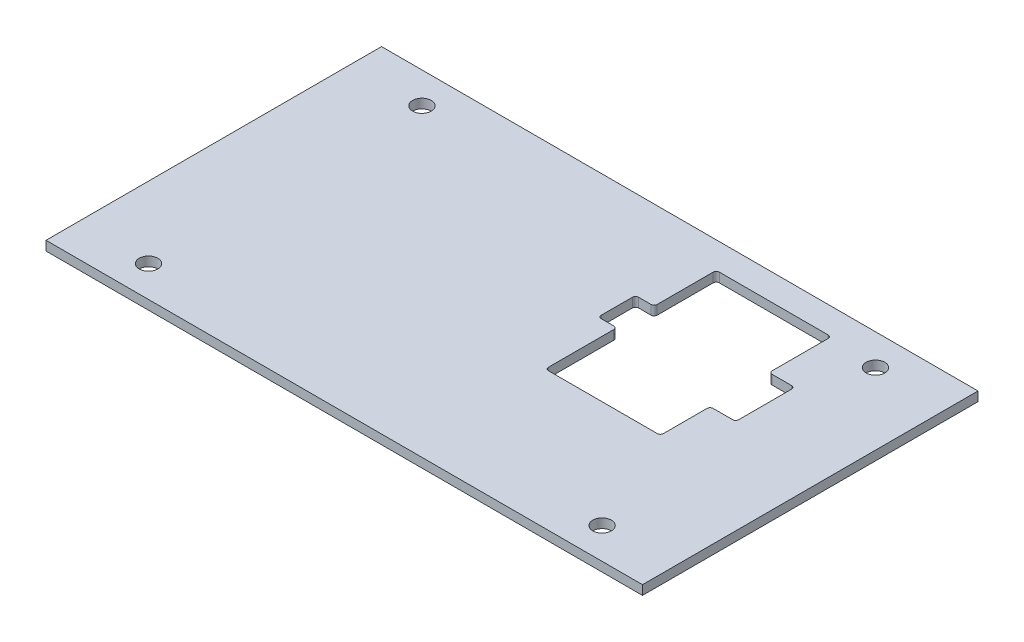
ISO-10303-21;
HEADER;
FILE_DESCRIPTION(('STEP AP214'),'2;1');
FILE_NAME('part.step','',(''),(''),'','','');
FILE_SCHEMA(('AUTOMOTIVE_DESIGN { 1 0 10303 214 1 1 1 1 }'));
ENDSEC;
DATA;
#1=APPLICATION_CONTEXT('core data for automotive mechanical design processes');
#2=APPLICATION_PROTOCOL_DEFINITION('international standard','automotive_design',2000,#1);
#3=PRODUCT_CONTEXT('',#1,'mechanical');
#4=PRODUCT('Part','Part','',(#3));
#5=PRODUCT_RELATED_PRODUCT_CATEGORY('part','',(#4));
#6=PRODUCT_DEFINITION_FORMATION('','',#4);
#7=PRODUCT_DEFINITION_CONTEXT('part definition',#1,'design');
#8=PRODUCT_DEFINITION('design','',#6,#7);
#9=PRODUCT_DEFINITION_SHAPE('','',#8);
#10=(LENGTH_UNIT() NAMED_UNIT(*) SI_UNIT(.MILLI.,.METRE.));
#11=(NAMED_UNIT(*) PLANE_ANGLE_UNIT() SI_UNIT($,.RADIAN.));
#12=(NAMED_UNIT(*) SI_UNIT($,.STERADIAN.) SOLID_ANGLE_UNIT());
#13=UNCERTAINTY_MEASURE_WITH_UNIT(LENGTH_MEASURE(1.E-05),#10,'distance_accuracy_value','');
#14=(GEOMETRIC_REPRESENTATION_CONTEXT(3) GLOBAL_UNCERTAINTY_ASSIGNED_CONTEXT((#13)) GLOBAL_UNIT_ASSIGNED_CONTEXT((#10,
#11,#12)) REPRESENTATION_CONTEXT('',''));
#15=CARTESIAN_POINT('',(0.,0.,0.));
#16=DIRECTION('',(0.,0.,1.));
#17=DIRECTION('',(1.,0.,0.));
#18=AXIS2_PLACEMENT_3D('',#15,#16,#17);
#19=CARTESIAN_POINT('',(96.,3.,54.));
#20=DIRECTION('',(-1.,0.,0.));
#21=DIRECTION('',(0.,0.,1.));
#22=AXIS2_PLACEMENT_3D('',#19,#20,#21);
#23=PLANE('',#22);
#24=DIRECTION('',(0.,0.,-1.));
#25=VECTOR('',#24,1.);
#26=CARTESIAN_POINT('',(96.,0.,54.));
#27=LINE('',#26,#25);
#28=CARTESIAN_POINT('',(96.,0.,54.));
#29=VERTEX_POINT('',#28);
#30=CARTESIAN_POINT('',(96.,0.,-54.));
#31=VERTEX_POINT('',#30);
#32=EDGE_CURVE('E241',#29,#31,#27,.T.);
#33=ORIENTED_EDGE('',*,*,#32,.T.);
#34=DIRECTION('',(0.,-1.,0.));
#35=VECTOR('',#34,1.);
#36=CARTESIAN_POINT('',(96.,3.,-54.));
#37=LINE('',#36,#35);
#38=CARTESIAN_POINT('',(96.,3.,-54.));
#39=VERTEX_POINT('',#38);
#40=EDGE_CURVE('E222',#39,#31,#37,.T.);
#41=ORIENTED_EDGE('',*,*,#40,.F.);
#42=DIRECTION('',(0.,0.,-1.));
#43=VECTOR('',#42,1.);
#44=CARTESIAN_POINT('',(96.,3.,54.));
#45=LINE('',#44,#43);
#46=CARTESIAN_POINT('',(96.,3.,54.));
#47=VERTEX_POINT('',#46);
#48=EDGE_CURVE('E229',#47,#39,#45,.T.);
#49=ORIENTED_EDGE('',*,*,#48,.F.);
#50=DIRECTION('',(0.,-1.,0.));
#51=VECTOR('',#50,1.);
#52=CARTESIAN_POINT('',(96.,3.,54.));
#53=LINE('',#52,#51);
#54=EDGE_CURVE('E464',#47,#29,#53,.T.);
#55=ORIENTED_EDGE('',*,*,#54,.T.);
#56=EDGE_LOOP('',(#33,#41,#49,#55));
#57=FACE_BOUND('',#56,.T.);
#58=ADVANCED_FACE('F32',(#57),#23,.F.);
#59=CARTESIAN_POINT('',(-96.,3.,-54.));
#60=DIRECTION('',(0.,0.,1.));
#61=DIRECTION('',(1.,0.,0.));
#62=AXIS2_PLACEMENT_3D('',#59,#60,#61);
#63=PLANE('',#62);
#64=DIRECTION('',(-1.,0.,0.));
#65=VECTOR('',#64,1.);
#66=CARTESIAN_POINT('',(-96.,0.,-54.));
#67=LINE('',#66,#65);
#68=CARTESIAN_POINT('',(-96.,0.,-54.));
#69=VERTEX_POINT('',#68);
#70=EDGE_CURVE('E466',#31,#69,#67,.T.);
#71=ORIENTED_EDGE('',*,*,#70,.T.);
#72=DIRECTION('',(0.,-1.,0.));
#73=VECTOR('',#72,1.);
#74=CARTESIAN_POINT('',(-96.,3.,-54.));
#75=LINE('',#74,#73);
#76=CARTESIAN_POINT('',(-96.,3.,-54.));
#77=VERTEX_POINT('',#76);
#78=EDGE_CURVE('E225',#77,#69,#75,.T.);
#79=ORIENTED_EDGE('',*,*,#78,.F.);
#80=DIRECTION('',(-1.,0.,0.));
#81=VECTOR('',#80,1.);
#82=CARTESIAN_POINT('',(-96.,3.,-54.));
#83=LINE('',#82,#81);
#84=EDGE_CURVE('E218',#39,#77,#83,.T.);
#85=ORIENTED_EDGE('',*,*,#84,.F.);
#86=ORIENTED_EDGE('',*,*,#40,.T.);
#87=EDGE_LOOP('',(#71,#79,#85,#86));
#88=FACE_BOUND('',#87,.T.);
#89=ADVANCED_FACE('F220',(#88),#63,.F.);
#90=CARTESIAN_POINT('',(-96.,3.,54.));
#91=DIRECTION('',(1.,0.,0.));
#92=DIRECTION('',(0.,0.,-1.));
#93=AXIS2_PLACEMENT_3D('',#90,#91,#92);
#94=PLANE('',#93);
#95=DIRECTION('',(0.,0.,1.));
#96=VECTOR('',#95,1.);
#97=CARTESIAN_POINT('',(-96.,0.,54.));
#98=LINE('',#97,#96);
#99=CARTESIAN_POINT('',(-96.,0.,54.));
#100=VERTEX_POINT('',#99);
#101=EDGE_CURVE('E468',#69,#100,#98,.T.);
#102=ORIENTED_EDGE('',*,*,#101,.T.);
#103=DIRECTION('',(0.,-1.,0.));
#104=VECTOR('',#103,1.);
#105=CARTESIAN_POINT('',(-96.,3.,54.));
#106=LINE('',#105,#104);
#107=CARTESIAN_POINT('',(-96.,3.,54.));
#108=VERTEX_POINT('',#107);
#109=EDGE_CURVE('E246',#108,#100,#106,.T.);
#110=ORIENTED_EDGE('',*,*,#109,.F.);
#111=DIRECTION('',(0.,0.,1.));
#112=VECTOR('',#111,1.);
#113=CARTESIAN_POINT('',(-96.,3.,54.));
#114=LINE('',#113,#112);
#115=EDGE_CURVE('E228',#77,#108,#114,.T.);
#116=ORIENTED_EDGE('',*,*,#115,.F.);
#117=ORIENTED_EDGE('',*,*,#78,.T.);
#118=EDGE_LOOP('',(#102,#110,#116,#117));
#119=FACE_BOUND('',#118,.T.);
#120=ADVANCED_FACE('F479',(#119),#94,.F.);
#121=CARTESIAN_POINT('',(-96.,3.,54.));
#122=DIRECTION('',(0.,0.,-1.));
#123=DIRECTION('',(-1.,0.,0.));
#124=AXIS2_PLACEMENT_3D('',#121,#122,#123);
#125=PLANE('',#124);
#126=DIRECTION('',(1.,0.,0.));
#127=VECTOR('',#126,1.);
#128=CARTESIAN_POINT('',(-96.,0.,54.));
#129=LINE('',#128,#127);
#130=EDGE_CURVE('E238',#100,#29,#129,.T.);
#131=ORIENTED_EDGE('',*,*,#130,.T.);
#132=ORIENTED_EDGE('',*,*,#54,.F.);
#133=DIRECTION('',(1.,0.,0.));
#134=VECTOR('',#133,1.);
#135=CARTESIAN_POINT('',(-96.,3.,54.));
#136=LINE('',#135,#134);
#137=EDGE_CURVE('E234',#108,#47,#136,.T.);
#138=ORIENTED_EDGE('',*,*,#137,.F.);
#139=ORIENTED_EDGE('',*,*,#109,.T.);
#140=EDGE_LOOP('',(#131,#132,#138,#139));
#141=FACE_BOUND('',#140,.T.);
#142=ADVANCED_FACE('F475',(#141),#125,.F.);
#143=CARTESIAN_POINT('',(0.,3.,0.));
#144=DIRECTION('',(0.,-1.,0.));
#145=DIRECTION('',(0.,0.,-1.));
#146=AXIS2_PLACEMENT_3D('',#143,#144,#145);
#147=PLANE('',#146);
#148=DIRECTION('',(0.,0.,1.));
#149=VECTOR('',#148,1.);
#150=CARTESIAN_POINT('',(20.25,3.,-13.5));
#151=LINE('',#150,#149);
#152=CARTESIAN_POINT('',(20.25,3.,-12.5));
#153=VERTEX_POINT('',#152);
#154=CARTESIAN_POINT('',(20.25,3.,8.5));
#155=VERTEX_POINT('',#154);
#156=EDGE_CURVE('E420',#153,#155,#151,.T.);
#157=ORIENTED_EDGE('',*,*,#156,.F.);
#158=CARTESIAN_POINT('',(19.25,3.,-12.5));
#159=DIRECTION('',(0.,-1.,0.));
#160=DIRECTION('',(0.,0.,-1.));
#161=AXIS2_PLACEMENT_3D('',#158,#159,#160);
#162=CIRCLE('',#161,1.);
#163=CARTESIAN_POINT('',(19.25,3.,-13.5));
#164=VERTEX_POINT('',#163);
#165=EDGE_CURVE('E268',#153,#164,#162,.F.);
#166=ORIENTED_EDGE('',*,*,#165,.T.);
#167=DIRECTION('',(1.,0.,0.));
#168=VECTOR('',#167,1.);
#169=CARTESIAN_POINT('',(14.25,3.,-13.5));
#170=LINE('',#169,#168);
#171=CARTESIAN_POINT('',(15.25,3.,-13.5));
#172=VERTEX_POINT('',#171);
#173=EDGE_CURVE('E417',#172,#164,#170,.T.);
#174=ORIENTED_EDGE('',*,*,#173,.F.);
#175=CARTESIAN_POINT('',(15.25,3.,-14.5));
#176=DIRECTION('',(0.,-1.,0.));
#177=DIRECTION('',(0.,0.,-1.));
#178=AXIS2_PLACEMENT_3D('',#175,#176,#177);
#179=CIRCLE('',#178,1.);
#180=CARTESIAN_POINT('',(14.25,3.,-14.5));
#181=VERTEX_POINT('',#180);
#182=EDGE_CURVE('E329',#172,#181,#179,.T.);
#183=ORIENTED_EDGE('',*,*,#182,.T.);
#184=DIRECTION('',(0.,0.,1.));
#185=VECTOR('',#184,1.);
#186=CARTESIAN_POINT('',(14.25,3.,-25.5));
#187=LINE('',#186,#185);
#188=CARTESIAN_POINT('',(14.25,3.,-24.5));
#189=VERTEX_POINT('',#188);
#190=EDGE_CURVE('E414',#189,#181,#187,.T.);
#191=ORIENTED_EDGE('',*,*,#190,.F.);
#192=CARTESIAN_POINT('',(15.25,3.,-24.5));
#193=DIRECTION('',(0.,-1.,0.));
#194=DIRECTION('',(0.,0.,-1.));
#195=AXIS2_PLACEMENT_3D('',#192,#193,#194);
#196=CIRCLE('',#195,1.);
#197=CARTESIAN_POINT('',(15.25,3.,-25.5));
#198=VERTEX_POINT('',#197);
#199=EDGE_CURVE('E341',#189,#198,#196,.T.);
#200=ORIENTED_EDGE('',*,*,#199,.T.);
#201=DIRECTION('',(-1.,0.,0.));
#202=VECTOR('',#201,1.);
#203=CARTESIAN_POINT('',(20.25,3.,-25.5));
#204=LINE('',#203,#202);
#205=CARTESIAN_POINT('',(19.25,3.,-25.5));
#206=VERTEX_POINT('',#205);
#207=EDGE_CURVE('E411',#206,#198,#204,.T.);
#208=ORIENTED_EDGE('',*,*,#207,.F.);
#209=CARTESIAN_POINT('',(19.25,3.,-26.5));
#210=DIRECTION('',(0.,-1.,0.));
#211=DIRECTION('',(0.,0.,-1.));
#212=AXIS2_PLACEMENT_3D('',#209,#210,#211);
#213=CIRCLE('',#212,1.);
#214=CARTESIAN_POINT('',(20.25,3.,-26.5));
#215=VERTEX_POINT('',#214);
#216=EDGE_CURVE('E262',#206,#215,#213,.F.);
#217=ORIENTED_EDGE('',*,*,#216,.T.);
#218=DIRECTION('',(0.,0.,1.));
#219=VECTOR('',#218,1.);
#220=CARTESIAN_POINT('',(20.25,3.,-45.5));
#221=LINE('',#220,#219);
#222=CARTESIAN_POINT('',(20.25,3.,-44.5));
#223=VERTEX_POINT('',#222);
#224=EDGE_CURVE('E356',#223,#215,#221,.T.);
#225=ORIENTED_EDGE('',*,*,#224,.F.);
#226=CARTESIAN_POINT('',(21.25,3.,-44.5));
#227=DIRECTION('',(0.,-1.,0.));
#228=DIRECTION('',(0.,0.,-1.));
#229=AXIS2_PLACEMENT_3D('',#226,#227,#228);
#230=CIRCLE('',#229,1.);
#231=CARTESIAN_POINT('',(21.25,3.,-45.5));
#232=VERTEX_POINT('',#231);
#233=EDGE_CURVE('E40',#223,#232,#230,.T.);
#234=ORIENTED_EDGE('',*,*,#233,.T.);
#235=DIRECTION('',(-1.,0.,0.));
#236=VECTOR('',#235,1.);
#237=CARTESIAN_POINT('',(57.25,3.,-45.5));
#238=LINE('',#237,#236);
#239=CARTESIAN_POINT('',(56.25,3.,-45.5));
#240=VERTEX_POINT('',#239);
#241=EDGE_CURVE('E354',#240,#232,#238,.T.);
#242=ORIENTED_EDGE('',*,*,#241,.F.);
#243=CARTESIAN_POINT('',(56.25,3.,-44.5));
#244=DIRECTION('',(0.,-1.,0.));
#245=DIRECTION('',(0.,0.,-1.));
#246=AXIS2_PLACEMENT_3D('',#243,#244,#245);
#247=CIRCLE('',#246,1.);
#248=CARTESIAN_POINT('',(57.25,3.,-44.5));
#249=VERTEX_POINT('',#248);
#250=EDGE_CURVE('E345',#240,#249,#247,.T.);
#251=ORIENTED_EDGE('',*,*,#250,.T.);
#252=DIRECTION('',(0.,0.,-1.));
#253=VECTOR('',#252,1.);
#254=CARTESIAN_POINT('',(57.25,3.,-25.5));
#255=LINE('',#254,#253);
#256=CARTESIAN_POINT('',(57.25,3.,-26.5));
#257=VERTEX_POINT('',#256);
#258=EDGE_CURVE('E383',#257,#249,#255,.T.);
#259=ORIENTED_EDGE('',*,*,#258,.F.);
#260=CARTESIAN_POINT('',(58.25,3.,-26.5));
#261=DIRECTION('',(0.,-1.,0.));
#262=DIRECTION('',(0.,0.,-1.));
#263=AXIS2_PLACEMENT_3D('',#260,#261,#262);
#264=CIRCLE('',#263,1.);
#265=CARTESIAN_POINT('',(58.25,3.,-25.5));
#266=VERTEX_POINT('',#265);
#267=EDGE_CURVE('E264',#257,#266,#264,.F.);
#268=ORIENTED_EDGE('',*,*,#267,.T.);
#269=DIRECTION('',(-1.,0.,0.));
#270=VECTOR('',#269,1.);
#271=CARTESIAN_POINT('',(65.5,3.,-25.5));
#272=LINE('',#271,#270);
#273=CARTESIAN_POINT('',(64.5,3.,-25.5));
#274=VERTEX_POINT('',#273);
#275=EDGE_CURVE('E435',#274,#266,#272,.T.);
#276=ORIENTED_EDGE('',*,*,#275,.F.);
#277=CARTESIAN_POINT('',(64.5,3.,-24.5));
#278=DIRECTION('',(0.,-1.,0.));
#279=DIRECTION('',(0.,0.,-1.));
#280=AXIS2_PLACEMENT_3D('',#277,#278,#279);
#281=CIRCLE('',#280,1.);
#282=CARTESIAN_POINT('',(65.5,3.,-24.5));
#283=VERTEX_POINT('',#282);
#284=EDGE_CURVE('E333',#274,#283,#281,.T.);
#285=ORIENTED_EDGE('',*,*,#284,.T.);
#286=DIRECTION('',(0.,0.,-1.));
#287=VECTOR('',#286,1.);
#288=CARTESIAN_POINT('',(65.5,3.,-6.5));
#289=LINE('',#288,#287);
#290=CARTESIAN_POINT('',(65.5,3.,-7.5));
#291=VERTEX_POINT('',#290);
#292=EDGE_CURVE('E432',#291,#283,#289,.T.);
#293=ORIENTED_EDGE('',*,*,#292,.F.);
#294=CARTESIAN_POINT('',(64.5,3.,-7.5));
#295=DIRECTION('',(0.,-1.,0.));
#296=DIRECTION('',(0.,0.,-1.));
#297=AXIS2_PLACEMENT_3D('',#294,#295,#296);
#298=CIRCLE('',#297,1.);
#299=CARTESIAN_POINT('',(64.5,3.,-6.5));
#300=VERTEX_POINT('',#299);
#301=EDGE_CURVE('E337',#291,#300,#298,.T.);
#302=ORIENTED_EDGE('',*,*,#301,.T.);
#303=DIRECTION('',(1.,0.,0.));
#304=VECTOR('',#303,1.);
#305=CARTESIAN_POINT('',(57.25,3.,-6.5));
#306=LINE('',#305,#304);
#307=CARTESIAN_POINT('',(58.25,3.,-6.5));
#308=VERTEX_POINT('',#307);
#309=EDGE_CURVE('E429',#308,#300,#306,.T.);
#310=ORIENTED_EDGE('',*,*,#309,.F.);
#311=CARTESIAN_POINT('',(58.25,3.,-5.5));
#312=DIRECTION('',(0.,-1.,0.));
#313=DIRECTION('',(0.,0.,-1.));
#314=AXIS2_PLACEMENT_3D('',#311,#312,#313);
#315=CIRCLE('',#314,1.);
#316=CARTESIAN_POINT('',(57.25,3.,-5.5));
#317=VERTEX_POINT('',#316);
#318=EDGE_CURVE('E266',#308,#317,#315,.F.);
#319=ORIENTED_EDGE('',*,*,#318,.T.);
#320=DIRECTION('',(0.,0.,-1.));
#321=VECTOR('',#320,1.);
#322=CARTESIAN_POINT('',(57.25,3.,9.5));
#323=LINE('',#322,#321);
#324=CARTESIAN_POINT('',(57.25,3.,8.5));
#325=VERTEX_POINT('',#324);
#326=EDGE_CURVE('E426',#325,#317,#323,.T.);
#327=ORIENTED_EDGE('',*,*,#326,.F.);
#328=CARTESIAN_POINT('',(56.25,3.,8.5));
#329=DIRECTION('',(0.,-1.,0.));
#330=DIRECTION('',(0.,0.,-1.));
#331=AXIS2_PLACEMENT_3D('',#328,#329,#330);
#332=CIRCLE('',#331,1.);
#333=CARTESIAN_POINT('',(56.25,3.,9.5));
#334=VERTEX_POINT('',#333);
#335=EDGE_CURVE('E321',#325,#334,#332,.T.);
#336=ORIENTED_EDGE('',*,*,#335,.T.);
#337=DIRECTION('',(1.,0.,0.));
#338=VECTOR('',#337,1.);
#339=CARTESIAN_POINT('',(20.25,3.,9.5));
#340=LINE('',#339,#338);
#341=CARTESIAN_POINT('',(21.25,3.,9.5));
#342=VERTEX_POINT('',#341);
#343=EDGE_CURVE('E423',#342,#334,#340,.T.);
#344=ORIENTED_EDGE('',*,*,#343,.F.);
#345=CARTESIAN_POINT('',(21.25,3.,8.5));
#346=DIRECTION('',(0.,-1.,0.));
#347=DIRECTION('',(0.,0.,-1.));
#348=AXIS2_PLACEMENT_3D('',#345,#346,#347);
#349=CIRCLE('',#348,1.);
#350=EDGE_CURVE('E325',#342,#155,#349,.T.);
#351=ORIENTED_EDGE('',*,*,#350,.T.);
#352=EDGE_LOOP('',(#157,#166,#174,#183,#191,#200,#208,#217,#225,#234,#242,#251,#259,#268,#276,
#285,#293,#302,#310,#319,#327,#336,#344,#351));
#353=FACE_BOUND('',#352,.T.);
#354=CARTESIAN_POINT('',(73.,3.,44.));
#355=DIRECTION('',(0.,1.,0.));
#356=DIRECTION('',(0.,0.,1.));
#357=AXIS2_PLACEMENT_3D('',#354,#355,#356);
#358=CIRCLE('',#357,3.00000000000001);
#359=CARTESIAN_POINT('',(73.,3.,47.));
#360=VERTEX_POINT('',#359);
#361=EDGE_CURVE('E408',#360,#360,#358,.T.);
#362=ORIENTED_EDGE('',*,*,#361,.F.);
#363=EDGE_LOOP('',(#362));
#364=FACE_BOUND('',#363,.T.);
#365=CARTESIAN_POINT('',(-73.,3.,44.));
#366=DIRECTION('',(0.,1.,0.));
#367=DIRECTION('',(0.,0.,1.));
#368=AXIS2_PLACEMENT_3D('',#365,#366,#367);
#369=CIRCLE('',#368,3.00000000000001);
#370=CARTESIAN_POINT('',(-73.,3.,47.));
#371=VERTEX_POINT('',#370);
#372=EDGE_CURVE('E442',#371,#371,#369,.T.);
#373=ORIENTED_EDGE('',*,*,#372,.F.);
#374=EDGE_LOOP('',(#373));
#375=FACE_BOUND('',#374,.T.);
#376=CARTESIAN_POINT('',(73.,3.,-44.));
#377=DIRECTION('',(0.,1.,0.));
#378=DIRECTION('',(0.,0.,1.));
#379=AXIS2_PLACEMENT_3D('',#376,#377,#378);
#380=CIRCLE('',#379,3.00000000000001);
#381=CARTESIAN_POINT('',(73.,3.,-41.));
#382=VERTEX_POINT('',#381);
#383=EDGE_CURVE('E448',#382,#382,#380,.T.);
#384=ORIENTED_EDGE('',*,*,#383,.F.);
#385=EDGE_LOOP('',(#384));
#386=FACE_BOUND('',#385,.T.);
#387=CARTESIAN_POINT('',(-73.,3.,-44.));
#388=DIRECTION('',(0.,1.,0.));
#389=DIRECTION('',(0.,0.,1.));
#390=AXIS2_PLACEMENT_3D('',#387,#388,#389);
#391=CIRCLE('',#390,3.00000000000001);
#392=CARTESIAN_POINT('',(-73.,3.,-41.));
#393=VERTEX_POINT('',#392);
#394=EDGE_CURVE('E454',#393,#393,#391,.T.);
#395=ORIENTED_EDGE('',*,*,#394,.F.);
#396=EDGE_LOOP('',(#395));
#397=FACE_BOUND('',#396,.T.);
#398=ORIENTED_EDGE('',*,*,#48,.T.);
#399=ORIENTED_EDGE('',*,*,#84,.T.);
#400=ORIENTED_EDGE('',*,*,#115,.T.);
#401=ORIENTED_EDGE('',*,*,#137,.T.);
#402=EDGE_LOOP('',(#398,#399,#400,#401));
#403=FACE_BOUND('',#402,.T.);
#404=ADVANCED_FACE('F232',(#353,#364,#375,#386,#397,#403),#147,.F.);
#405=CARTESIAN_POINT('',(0.,0.,0.));
#406=DIRECTION('',(0.,-1.,0.));
#407=DIRECTION('',(0.,0.,-1.));
#408=AXIS2_PLACEMENT_3D('',#405,#406,#407);
#409=PLANE('',#408);
#410=DIRECTION('',(1.,0.,0.));
#411=VECTOR('',#410,1.);
#412=CARTESIAN_POINT('',(14.25,0.,-13.5));
#413=LINE('',#412,#411);
#414=CARTESIAN_POINT('',(15.25,0.,-13.5));
#415=VERTEX_POINT('',#414);
#416=CARTESIAN_POINT('',(19.25,0.,-13.5));
#417=VERTEX_POINT('',#416);
#418=EDGE_CURVE('E388',#415,#417,#413,.T.);
#419=ORIENTED_EDGE('',*,*,#418,.T.);
#420=CARTESIAN_POINT('',(19.25,0.,-12.5));
#421=DIRECTION('',(0.,-1.,0.));
#422=DIRECTION('',(0.,0.,-1.));
#423=AXIS2_PLACEMENT_3D('',#420,#421,#422);
#424=CIRCLE('',#423,1.);
#425=CARTESIAN_POINT('',(20.25,0.,-12.5));
#426=VERTEX_POINT('',#425);
#427=EDGE_CURVE('E280',#417,#426,#424,.T.);
#428=ORIENTED_EDGE('',*,*,#427,.T.);
#429=DIRECTION('',(0.,0.,1.));
#430=VECTOR('',#429,1.);
#431=CARTESIAN_POINT('',(20.25,0.,-13.5));
#432=LINE('',#431,#430);
#433=CARTESIAN_POINT('',(20.25,0.,8.5));
#434=VERTEX_POINT('',#433);
#435=EDGE_CURVE('E390',#426,#434,#432,.T.);
#436=ORIENTED_EDGE('',*,*,#435,.T.);
#437=CARTESIAN_POINT('',(21.25,0.,8.5));
#438=DIRECTION('',(0.,-1.,0.));
#439=DIRECTION('',(0.,0.,-1.));
#440=AXIS2_PLACEMENT_3D('',#437,#438,#439);
#441=CIRCLE('',#440,1.);
#442=CARTESIAN_POINT('',(21.25,0.,9.5));
#443=VERTEX_POINT('',#442);
#444=EDGE_CURVE('E327',#434,#443,#441,.F.);
#445=ORIENTED_EDGE('',*,*,#444,.T.);
#446=DIRECTION('',(1.,0.,0.));
#447=VECTOR('',#446,1.);
#448=CARTESIAN_POINT('',(20.25,0.,9.5));
#449=LINE('',#448,#447);
#450=CARTESIAN_POINT('',(56.25,0.,9.5));
#451=VERTEX_POINT('',#450);
#452=EDGE_CURVE('E393',#443,#451,#449,.T.);
#453=ORIENTED_EDGE('',*,*,#452,.T.);
#454=CARTESIAN_POINT('',(56.25,0.,8.5));
#455=DIRECTION('',(0.,-1.,0.));
#456=DIRECTION('',(0.,0.,-1.));
#457=AXIS2_PLACEMENT_3D('',#454,#455,#456);
#458=CIRCLE('',#457,1.);
#459=CARTESIAN_POINT('',(57.25,0.,8.5));
#460=VERTEX_POINT('',#459);
#461=EDGE_CURVE('E323',#451,#460,#458,.F.);
#462=ORIENTED_EDGE('',*,*,#461,.T.);
#463=DIRECTION('',(0.,0.,-1.));
#464=VECTOR('',#463,1.);
#465=CARTESIAN_POINT('',(57.25,0.,9.5));
#466=LINE('',#465,#464);
#467=CARTESIAN_POINT('',(57.25,0.,-5.5));
#468=VERTEX_POINT('',#467);
#469=EDGE_CURVE('E396',#460,#468,#466,.T.);
#470=ORIENTED_EDGE('',*,*,#469,.T.);
#471=CARTESIAN_POINT('',(58.25,0.,-5.5));
#472=DIRECTION('',(0.,-1.,0.));
#473=DIRECTION('',(0.,0.,-1.));
#474=AXIS2_PLACEMENT_3D('',#471,#472,#473);
#475=CIRCLE('',#474,1.);
#476=CARTESIAN_POINT('',(58.25,0.,-6.5));
#477=VERTEX_POINT('',#476);
#478=EDGE_CURVE('E278',#468,#477,#475,.T.);
#479=ORIENTED_EDGE('',*,*,#478,.T.);
#480=DIRECTION('',(1.,0.,0.));
#481=VECTOR('',#480,1.);
#482=CARTESIAN_POINT('',(57.25,0.,-6.5));
#483=LINE('',#482,#481);
#484=CARTESIAN_POINT('',(64.5,0.,-6.5));
#485=VERTEX_POINT('',#484);
#486=EDGE_CURVE('E399',#477,#485,#483,.T.);
#487=ORIENTED_EDGE('',*,*,#486,.T.);
#488=CARTESIAN_POINT('',(64.5,0.,-7.5));
#489=DIRECTION('',(0.,-1.,0.));
#490=DIRECTION('',(0.,0.,-1.));
#491=AXIS2_PLACEMENT_3D('',#488,#489,#490);
#492=CIRCLE('',#491,1.);
#493=CARTESIAN_POINT('',(65.5,0.,-7.5));
#494=VERTEX_POINT('',#493);
#495=EDGE_CURVE('E339',#485,#494,#492,.F.);
#496=ORIENTED_EDGE('',*,*,#495,.T.);
#497=DIRECTION('',(0.,0.,-1.));
#498=VECTOR('',#497,1.);
#499=CARTESIAN_POINT('',(65.5,0.,-6.5));
#500=LINE('',#499,#498);
#501=CARTESIAN_POINT('',(65.5,0.,-24.5));
#502=VERTEX_POINT('',#501);
#503=EDGE_CURVE('E402',#494,#502,#500,.T.);
#504=ORIENTED_EDGE('',*,*,#503,.T.);
#505=CARTESIAN_POINT('',(64.5,0.,-24.5));
#506=DIRECTION('',(0.,-1.,0.));
#507=DIRECTION('',(0.,0.,-1.));
#508=AXIS2_PLACEMENT_3D('',#505,#506,#507);
#509=CIRCLE('',#508,1.);
#510=CARTESIAN_POINT('',(64.5,0.,-25.5));
#511=VERTEX_POINT('',#510);
#512=EDGE_CURVE('E335',#502,#511,#509,.F.);
#513=ORIENTED_EDGE('',*,*,#512,.T.);
#514=DIRECTION('',(-1.,0.,0.));
#515=VECTOR('',#514,1.);
#516=CARTESIAN_POINT('',(65.5,0.,-25.5));
#517=LINE('',#516,#515);
#518=CARTESIAN_POINT('',(58.25,0.,-25.5));
#519=VERTEX_POINT('',#518);
#520=EDGE_CURVE('E405',#511,#519,#517,.T.);
#521=ORIENTED_EDGE('',*,*,#520,.T.);
#522=CARTESIAN_POINT('',(58.25,0.,-26.5));
#523=DIRECTION('',(0.,-1.,0.));
#524=DIRECTION('',(0.,0.,-1.));
#525=AXIS2_PLACEMENT_3D('',#522,#523,#524);
#526=CIRCLE('',#525,1.);
#527=CARTESIAN_POINT('',(57.25,0.,-26.5));
#528=VERTEX_POINT('',#527);
#529=EDGE_CURVE('E54',#519,#528,#526,.T.);
#530=ORIENTED_EDGE('',*,*,#529,.T.);
#531=DIRECTION('',(0.,0.,-1.));
#532=VECTOR('',#531,1.);
#533=CARTESIAN_POINT('',(57.25,0.,-25.5));
#534=LINE('',#533,#532);
#535=CARTESIAN_POINT('',(57.25,0.,-44.5));
#536=VERTEX_POINT('',#535);
#537=EDGE_CURVE('E407',#528,#536,#534,.T.);
#538=ORIENTED_EDGE('',*,*,#537,.T.);
#539=CARTESIAN_POINT('',(56.25,0.,-44.5));
#540=DIRECTION('',(0.,-1.,0.));
#541=DIRECTION('',(0.,0.,-1.));
#542=AXIS2_PLACEMENT_3D('',#539,#540,#541);
#543=CIRCLE('',#542,1.);
#544=CARTESIAN_POINT('',(56.25,0.,-45.5));
#545=VERTEX_POINT('',#544);
#546=EDGE_CURVE('E347',#536,#545,#543,.F.);
#547=ORIENTED_EDGE('',*,*,#546,.T.);
#548=DIRECTION('',(-1.,0.,0.));
#549=VECTOR('',#548,1.);
#550=CARTESIAN_POINT('',(57.25,0.,-45.5));
#551=LINE('',#550,#549);
#552=CARTESIAN_POINT('',(21.25,0.,-45.5));
#553=VERTEX_POINT('',#552);
#554=EDGE_CURVE('E374',#545,#553,#551,.T.);
#555=ORIENTED_EDGE('',*,*,#554,.T.);
#556=CARTESIAN_POINT('',(21.25,0.,-44.5));
#557=DIRECTION('',(0.,-1.,0.));
#558=DIRECTION('',(0.,0.,-1.));
#559=AXIS2_PLACEMENT_3D('',#556,#557,#558);
#560=CIRCLE('',#559,1.);
#561=CARTESIAN_POINT('',(20.25,0.,-44.5));
#562=VERTEX_POINT('',#561);
#563=EDGE_CURVE('E11',#553,#562,#560,.F.);
#564=ORIENTED_EDGE('',*,*,#563,.T.);
#565=DIRECTION('',(0.,0.,1.));
#566=VECTOR('',#565,1.);
#567=CARTESIAN_POINT('',(20.25,0.,-45.5));
#568=LINE('',#567,#566);
#569=CARTESIAN_POINT('',(20.25,0.,-26.5));
#570=VERTEX_POINT('',#569);
#571=EDGE_CURVE('E372',#562,#570,#568,.T.);
#572=ORIENTED_EDGE('',*,*,#571,.T.);
#573=CARTESIAN_POINT('',(19.25,0.,-26.5));
#574=DIRECTION('',(0.,-1.,0.));
#575=DIRECTION('',(0.,0.,-1.));
#576=AXIS2_PLACEMENT_3D('',#573,#574,#575);
#577=CIRCLE('',#576,1.);
#578=CARTESIAN_POINT('',(19.25,0.,-25.5));
#579=VERTEX_POINT('',#578);
#580=EDGE_CURVE('E275',#570,#579,#577,.T.);
#581=ORIENTED_EDGE('',*,*,#580,.T.);
#582=DIRECTION('',(-1.,0.,0.));
#583=VECTOR('',#582,1.);
#584=CARTESIAN_POINT('',(20.25,0.,-25.5));
#585=LINE('',#584,#583);
#586=CARTESIAN_POINT('',(15.25,0.,-25.5));
#587=VERTEX_POINT('',#586);
#588=EDGE_CURVE('E378',#579,#587,#585,.T.);
#589=ORIENTED_EDGE('',*,*,#588,.T.);
#590=CARTESIAN_POINT('',(15.25,0.,-24.5));
#591=DIRECTION('',(0.,-1.,0.));
#592=DIRECTION('',(0.,0.,-1.));
#593=AXIS2_PLACEMENT_3D('',#590,#591,#592);
#594=CIRCLE('',#593,1.);
#595=CARTESIAN_POINT('',(14.25,0.,-24.5));
#596=VERTEX_POINT('',#595);
#597=EDGE_CURVE('E343',#587,#596,#594,.F.);
#598=ORIENTED_EDGE('',*,*,#597,.T.);
#599=DIRECTION('',(0.,0.,1.));
#600=VECTOR('',#599,1.);
#601=CARTESIAN_POINT('',(14.25,0.,-25.5));
#602=LINE('',#601,#600);
#603=CARTESIAN_POINT('',(14.25,0.,-14.5));
#604=VERTEX_POINT('',#603);
#605=EDGE_CURVE('E381',#596,#604,#602,.T.);
#606=ORIENTED_EDGE('',*,*,#605,.T.);
#607=CARTESIAN_POINT('',(15.25,0.,-14.5));
#608=DIRECTION('',(0.,-1.,0.));
#609=DIRECTION('',(0.,0.,-1.));
#610=AXIS2_PLACEMENT_3D('',#607,#608,#609);
#611=CIRCLE('',#610,1.);
#612=EDGE_CURVE('E331',#604,#415,#611,.F.);
#613=ORIENTED_EDGE('',*,*,#612,.T.);
#614=EDGE_LOOP('',(#419,#428,#436,#445,#453,#462,#470,#479,#487,#496,#504,#513,#521,#530,#538,
#547,#555,#564,#572,#581,#589,#598,#606,#613));
#615=FACE_BOUND('',#614,.T.);
#616=CARTESIAN_POINT('',(73.,0.,44.));
#617=DIRECTION('',(0.,1.,0.));
#618=DIRECTION('',(0.,0.,1.));
#619=AXIS2_PLACEMENT_3D('',#616,#617,#618);
#620=CIRCLE('',#619,3.00000000000001);
#621=CARTESIAN_POINT('',(73.,0.,47.));
#622=VERTEX_POINT('',#621);
#623=EDGE_CURVE('E439',#622,#622,#620,.T.);
#624=ORIENTED_EDGE('',*,*,#623,.T.);
#625=EDGE_LOOP('',(#624));
#626=FACE_BOUND('',#625,.T.);
#627=CARTESIAN_POINT('',(-73.,0.,44.));
#628=DIRECTION('',(0.,1.,0.));
#629=DIRECTION('',(0.,0.,1.));
#630=AXIS2_PLACEMENT_3D('',#627,#628,#629);
#631=CIRCLE('',#630,3.00000000000001);
#632=CARTESIAN_POINT('',(-73.,0.,47.));
#633=VERTEX_POINT('',#632);
#634=EDGE_CURVE('E445',#633,#633,#631,.T.);
#635=ORIENTED_EDGE('',*,*,#634,.T.);
#636=EDGE_LOOP('',(#635));
#637=FACE_BOUND('',#636,.T.);
#638=CARTESIAN_POINT('',(73.,0.,-44.));
#639=DIRECTION('',(0.,1.,0.));
#640=DIRECTION('',(0.,0.,1.));
#641=AXIS2_PLACEMENT_3D('',#638,#639,#640);
#642=CIRCLE('',#641,3.00000000000001);
#643=CARTESIAN_POINT('',(73.,0.,-41.));
#644=VERTEX_POINT('',#643);
#645=EDGE_CURVE('E451',#644,#644,#642,.T.);
#646=ORIENTED_EDGE('',*,*,#645,.T.);
#647=EDGE_LOOP('',(#646));
#648=FACE_BOUND('',#647,.T.);
#649=CARTESIAN_POINT('',(-73.,0.,-44.));
#650=DIRECTION('',(0.,1.,0.));
#651=DIRECTION('',(0.,0.,1.));
#652=AXIS2_PLACEMENT_3D('',#649,#650,#651);
#653=CIRCLE('',#652,3.00000000000001);
#654=CARTESIAN_POINT('',(-73.,0.,-41.));
#655=VERTEX_POINT('',#654);
#656=EDGE_CURVE('E457',#655,#655,#653,.T.);
#657=ORIENTED_EDGE('',*,*,#656,.T.);
#658=EDGE_LOOP('',(#657));
#659=FACE_BOUND('',#658,.T.);
#660=ORIENTED_EDGE('',*,*,#32,.F.);
#661=ORIENTED_EDGE('',*,*,#130,.F.);
#662=ORIENTED_EDGE('',*,*,#101,.F.);
#663=ORIENTED_EDGE('',*,*,#70,.F.);
#664=EDGE_LOOP('',(#660,#661,#662,#663));
#665=FACE_BOUND('',#664,.T.);
#666=ADVANCED_FACE('F370',(#615,#626,#637,#648,#659,#665),#409,.T.);
#667=CARTESIAN_POINT('',(-73.,0.,-44.));
#668=DIRECTION('',(0.,1.,0.));
#669=DIRECTION('',(0.,0.,1.));
#670=AXIS2_PLACEMENT_3D('',#667,#668,#669);
#671=CYLINDRICAL_SURFACE('',#670,3.00000000000001);
#672=ORIENTED_EDGE('',*,*,#656,.F.);
#673=EDGE_LOOP('',(#672));
#674=FACE_BOUND('',#673,.T.);
#675=ORIENTED_EDGE('',*,*,#394,.T.);
#676=EDGE_LOOP('',(#675));
#677=FACE_BOUND('',#676,.T.);
#678=ADVANCED_FACE('F626',(#674,#677),#671,.F.);
#679=CARTESIAN_POINT('',(73.,0.,-44.));
#680=DIRECTION('',(0.,1.,0.));
#681=DIRECTION('',(0.,0.,1.));
#682=AXIS2_PLACEMENT_3D('',#679,#680,#681);
#683=CYLINDRICAL_SURFACE('',#682,3.00000000000001);
#684=ORIENTED_EDGE('',*,*,#645,.F.);
#685=EDGE_LOOP('',(#684));
#686=FACE_BOUND('',#685,.T.);
#687=ORIENTED_EDGE('',*,*,#383,.T.);
#688=EDGE_LOOP('',(#687));
#689=FACE_BOUND('',#688,.T.);
#690=ADVANCED_FACE('F622',(#686,#689),#683,.F.);
#691=CARTESIAN_POINT('',(-73.,0.,44.));
#692=DIRECTION('',(0.,1.,0.));
#693=DIRECTION('',(0.,0.,1.));
#694=AXIS2_PLACEMENT_3D('',#691,#692,#693);
#695=CYLINDRICAL_SURFACE('',#694,3.00000000000001);
#696=ORIENTED_EDGE('',*,*,#634,.F.);
#697=EDGE_LOOP('',(#696));
#698=FACE_BOUND('',#697,.T.);
#699=ORIENTED_EDGE('',*,*,#372,.T.);
#700=EDGE_LOOP('',(#699));
#701=FACE_BOUND('',#700,.T.);
#702=ADVANCED_FACE('F618',(#698,#701),#695,.F.);
#703=CARTESIAN_POINT('',(73.,0.,44.));
#704=DIRECTION('',(0.,1.,0.));
#705=DIRECTION('',(0.,0.,1.));
#706=AXIS2_PLACEMENT_3D('',#703,#704,#705);
#707=CYLINDRICAL_SURFACE('',#706,3.00000000000001);
#708=ORIENTED_EDGE('',*,*,#623,.F.);
#709=EDGE_LOOP('',(#708));
#710=FACE_BOUND('',#709,.T.);
#711=ORIENTED_EDGE('',*,*,#361,.T.);
#712=EDGE_LOOP('',(#711));
#713=FACE_BOUND('',#712,.T.);
#714=ADVANCED_FACE('F615',(#710,#713),#707,.F.);
#715=CARTESIAN_POINT('',(57.25,0.,-45.5));
#716=DIRECTION('',(0.,0.,-1.));
#717=DIRECTION('',(-1.,0.,0.));
#718=AXIS2_PLACEMENT_3D('',#715,#716,#717);
#719=PLANE('',#718);
#720=ORIENTED_EDGE('',*,*,#554,.F.);
#721=DIRECTION('',(0.,1.,0.));
#722=VECTOR('',#721,1.);
#723=CARTESIAN_POINT('',(56.25,3.,-45.5));
#724=LINE('',#723,#722);
#725=EDGE_CURVE('E318',#545,#240,#724,.T.);
#726=ORIENTED_EDGE('',*,*,#725,.T.);
#727=ORIENTED_EDGE('',*,*,#241,.T.);
#728=DIRECTION('',(0.,1.,0.));
#729=VECTOR('',#728,1.);
#730=CARTESIAN_POINT('',(21.25,0.,-45.5));
#731=LINE('',#730,#729);
#732=EDGE_CURVE('E316',#232,#553,#731,.F.);
#733=ORIENTED_EDGE('',*,*,#732,.T.);
#734=EDGE_LOOP('',(#720,#726,#727,#733));
#735=FACE_BOUND('',#734,.T.);
#736=ADVANCED_FACE('F362',(#735),#719,.F.);
#737=CARTESIAN_POINT('',(57.25,0.,-25.5));
#738=DIRECTION('',(1.,0.,0.));
#739=DIRECTION('',(0.,0.,-1.));
#740=AXIS2_PLACEMENT_3D('',#737,#738,#739);
#741=PLANE('',#740);
#742=ORIENTED_EDGE('',*,*,#537,.F.);
#743=DIRECTION('',(0.,1.,0.));
#744=VECTOR('',#743,1.);
#745=CARTESIAN_POINT('',(57.25,0.,-26.5));
#746=LINE('',#745,#744);
#747=EDGE_CURVE('E303',#528,#257,#746,.T.);
#748=ORIENTED_EDGE('',*,*,#747,.T.);
#749=ORIENTED_EDGE('',*,*,#258,.T.);
#750=DIRECTION('',(0.,1.,0.));
#751=VECTOR('',#750,1.);
#752=CARTESIAN_POINT('',(57.25,0.,-44.5));
#753=LINE('',#752,#751);
#754=EDGE_CURVE('E47',#249,#536,#753,.F.);
#755=ORIENTED_EDGE('',*,*,#754,.T.);
#756=EDGE_LOOP('',(#742,#748,#749,#755));
#757=FACE_BOUND('',#756,.T.);
#758=ADVANCED_FACE('F540',(#757),#741,.F.);
#759=CARTESIAN_POINT('',(65.5,0.,-25.5));
#760=DIRECTION('',(0.,0.,-1.));
#761=DIRECTION('',(-1.,0.,0.));
#762=AXIS2_PLACEMENT_3D('',#759,#760,#761);
#763=PLANE('',#762);
#764=ORIENTED_EDGE('',*,*,#520,.F.);
#765=DIRECTION('',(0.,1.,0.));
#766=VECTOR('',#765,1.);
#767=CARTESIAN_POINT('',(64.5,3.,-25.5));
#768=LINE('',#767,#766);
#769=EDGE_CURVE('E289',#511,#274,#768,.T.);
#770=ORIENTED_EDGE('',*,*,#769,.T.);
#771=ORIENTED_EDGE('',*,*,#275,.T.);
#772=DIRECTION('',(0.,1.,0.));
#773=VECTOR('',#772,1.);
#774=CARTESIAN_POINT('',(58.25,0.,-25.5));
#775=LINE('',#774,#773);
#776=EDGE_CURVE('E287',#266,#519,#775,.F.);
#777=ORIENTED_EDGE('',*,*,#776,.T.);
#778=EDGE_LOOP('',(#764,#770,#771,#777));
#779=FACE_BOUND('',#778,.T.);
#780=ADVANCED_FACE('F546',(#779),#763,.F.);
#781=CARTESIAN_POINT('',(65.5,0.,-6.5));
#782=DIRECTION('',(1.,0.,0.));
#783=DIRECTION('',(0.,0.,-1.));
#784=AXIS2_PLACEMENT_3D('',#781,#782,#783);
#785=PLANE('',#784);
#786=ORIENTED_EDGE('',*,*,#292,.T.);
#787=DIRECTION('',(0.,1.,0.));
#788=VECTOR('',#787,1.);
#789=CARTESIAN_POINT('',(65.5,0.,-24.5));
#790=LINE('',#789,#788);
#791=EDGE_CURVE('E295',#283,#502,#790,.F.);
#792=ORIENTED_EDGE('',*,*,#791,.T.);
#793=ORIENTED_EDGE('',*,*,#503,.F.);
#794=DIRECTION('',(0.,1.,0.));
#795=VECTOR('',#794,1.);
#796=CARTESIAN_POINT('',(65.5,3.,-7.5));
#797=LINE('',#796,#795);
#798=EDGE_CURVE('E292',#494,#291,#797,.T.);
#799=ORIENTED_EDGE('',*,*,#798,.T.);
#800=EDGE_LOOP('',(#786,#792,#793,#799));
#801=FACE_BOUND('',#800,.T.);
#802=ADVANCED_FACE('F552',(#801),#785,.F.);
#803=CARTESIAN_POINT('',(57.25,0.,-6.5));
#804=DIRECTION('',(0.,0.,1.));
#805=DIRECTION('',(1.,0.,0.));
#806=AXIS2_PLACEMENT_3D('',#803,#804,#805);
#807=PLANE('',#806);
#808=ORIENTED_EDGE('',*,*,#309,.T.);
#809=DIRECTION('',(0.,1.,0.));
#810=VECTOR('',#809,1.);
#811=CARTESIAN_POINT('',(64.5,0.,-6.5));
#812=LINE('',#811,#810);
#813=EDGE_CURVE('E300',#300,#485,#812,.F.);
#814=ORIENTED_EDGE('',*,*,#813,.T.);
#815=ORIENTED_EDGE('',*,*,#486,.F.);
#816=DIRECTION('',(0.,1.,0.));
#817=VECTOR('',#816,1.);
#818=CARTESIAN_POINT('',(58.25,0.,-6.5));
#819=LINE('',#818,#817);
#820=EDGE_CURVE('E297',#477,#308,#819,.T.);
#821=ORIENTED_EDGE('',*,*,#820,.T.);
#822=EDGE_LOOP('',(#808,#814,#815,#821));
#823=FACE_BOUND('',#822,.T.);
#824=ADVANCED_FACE('F559',(#823),#807,.F.);
#825=CARTESIAN_POINT('',(57.25,0.,9.5));
#826=DIRECTION('',(1.,0.,0.));
#827=DIRECTION('',(0.,0.,-1.));
#828=AXIS2_PLACEMENT_3D('',#825,#826,#827);
#829=PLANE('',#828);
#830=ORIENTED_EDGE('',*,*,#469,.F.);
#831=DIRECTION('',(0.,1.,0.));
#832=VECTOR('',#831,1.);
#833=CARTESIAN_POINT('',(57.25,3.,8.5));
#834=LINE('',#833,#832);
#835=EDGE_CURVE('E244',#460,#325,#834,.T.);
#836=ORIENTED_EDGE('',*,*,#835,.T.);
#837=ORIENTED_EDGE('',*,*,#326,.T.);
#838=DIRECTION('',(0.,1.,0.));
#839=VECTOR('',#838,1.);
#840=CARTESIAN_POINT('',(57.25,0.,-5.5));
#841=LINE('',#840,#839);
#842=EDGE_CURVE('E242',#317,#468,#841,.F.);
#843=ORIENTED_EDGE('',*,*,#842,.T.);
#844=EDGE_LOOP('',(#830,#836,#837,#843));
#845=FACE_BOUND('',#844,.T.);
#846=ADVANCED_FACE('F567',(#845),#829,.F.);
#847=CARTESIAN_POINT('',(20.25,0.,9.5));
#848=DIRECTION('',(0.,0.,1.));
#849=DIRECTION('',(1.,0.,0.));
#850=AXIS2_PLACEMENT_3D('',#847,#848,#849);
#851=PLANE('',#850);
#852=ORIENTED_EDGE('',*,*,#343,.T.);
#853=DIRECTION('',(0.,1.,0.));
#854=VECTOR('',#853,1.);
#855=CARTESIAN_POINT('',(56.25,0.,9.5));
#856=LINE('',#855,#854);
#857=EDGE_CURVE('E255',#334,#451,#856,.F.);
#858=ORIENTED_EDGE('',*,*,#857,.T.);
#859=ORIENTED_EDGE('',*,*,#452,.F.);
#860=DIRECTION('',(0.,1.,0.));
#861=VECTOR('',#860,1.);
#862=CARTESIAN_POINT('',(21.25,3.,9.5));
#863=LINE('',#862,#861);
#864=EDGE_CURVE('E252',#443,#342,#863,.T.);
#865=ORIENTED_EDGE('',*,*,#864,.T.);
#866=EDGE_LOOP('',(#852,#858,#859,#865));
#867=FACE_BOUND('',#866,.T.);
#868=ADVANCED_FACE('F573',(#867),#851,.F.);
#869=CARTESIAN_POINT('',(20.25,0.,-13.5));
#870=DIRECTION('',(-1.,0.,0.));
#871=DIRECTION('',(0.,0.,1.));
#872=AXIS2_PLACEMENT_3D('',#869,#870,#871);
#873=PLANE('',#872);
#874=ORIENTED_EDGE('',*,*,#156,.T.);
#875=DIRECTION('',(0.,1.,0.));
#876=VECTOR('',#875,1.);
#877=CARTESIAN_POINT('',(20.25,0.,8.5));
#878=LINE('',#877,#876);
#879=EDGE_CURVE('E260',#155,#434,#878,.F.);
#880=ORIENTED_EDGE('',*,*,#879,.T.);
#881=ORIENTED_EDGE('',*,*,#435,.F.);
#882=DIRECTION('',(0.,1.,0.));
#883=VECTOR('',#882,1.);
#884=CARTESIAN_POINT('',(20.25,0.,-12.5));
#885=LINE('',#884,#883);
#886=EDGE_CURVE('E257',#426,#153,#885,.T.);
#887=ORIENTED_EDGE('',*,*,#886,.T.);
#888=EDGE_LOOP('',(#874,#880,#881,#887));
#889=FACE_BOUND('',#888,.T.);
#890=ADVANCED_FACE('F579',(#889),#873,.F.);
#891=CARTESIAN_POINT('',(14.25,0.,-13.5));
#892=DIRECTION('',(0.,0.,1.));
#893=DIRECTION('',(1.,0.,0.));
#894=AXIS2_PLACEMENT_3D('',#891,#892,#893);
#895=PLANE('',#894);
#896=ORIENTED_EDGE('',*,*,#173,.T.);
#897=DIRECTION('',(0.,1.,0.));
#898=VECTOR('',#897,1.);
#899=CARTESIAN_POINT('',(19.25,0.,-13.5));
#900=LINE('',#899,#898);
#901=EDGE_CURVE('E273',#164,#417,#900,.F.);
#902=ORIENTED_EDGE('',*,*,#901,.T.);
#903=ORIENTED_EDGE('',*,*,#418,.F.);
#904=DIRECTION('',(0.,1.,0.));
#905=VECTOR('',#904,1.);
#906=CARTESIAN_POINT('',(15.25,3.,-13.5));
#907=LINE('',#906,#905);
#908=EDGE_CURVE('E270',#415,#172,#907,.T.);
#909=ORIENTED_EDGE('',*,*,#908,.T.);
#910=EDGE_LOOP('',(#896,#902,#903,#909));
#911=FACE_BOUND('',#910,.T.);
#912=ADVANCED_FACE('F586',(#911),#895,.F.);
#913=CARTESIAN_POINT('',(14.25,0.,-25.5));
#914=DIRECTION('',(-1.,0.,0.));
#915=DIRECTION('',(0.,0.,1.));
#916=AXIS2_PLACEMENT_3D('',#913,#914,#915);
#917=PLANE('',#916);
#918=ORIENTED_EDGE('',*,*,#190,.T.);
#919=DIRECTION('',(0.,1.,0.));
#920=VECTOR('',#919,1.);
#921=CARTESIAN_POINT('',(14.25,0.,-14.5));
#922=LINE('',#921,#920);
#923=EDGE_CURVE('E285',#181,#604,#922,.F.);
#924=ORIENTED_EDGE('',*,*,#923,.T.);
#925=ORIENTED_EDGE('',*,*,#605,.F.);
#926=DIRECTION('',(0.,1.,0.));
#927=VECTOR('',#926,1.);
#928=CARTESIAN_POINT('',(14.25,3.,-24.5));
#929=LINE('',#928,#927);
#930=EDGE_CURVE('E282',#596,#189,#929,.T.);
#931=ORIENTED_EDGE('',*,*,#930,.T.);
#932=EDGE_LOOP('',(#918,#924,#925,#931));
#933=FACE_BOUND('',#932,.T.);
#934=ADVANCED_FACE('F593',(#933),#917,.F.);
#935=CARTESIAN_POINT('',(20.25,0.,-25.5));
#936=DIRECTION('',(0.,0.,-1.));
#937=DIRECTION('',(-1.,0.,0.));
#938=AXIS2_PLACEMENT_3D('',#935,#936,#937);
#939=PLANE('',#938);
#940=ORIENTED_EDGE('',*,*,#588,.F.);
#941=DIRECTION('',(0.,1.,0.));
#942=VECTOR('',#941,1.);
#943=CARTESIAN_POINT('',(19.25,0.,-25.5));
#944=LINE('',#943,#942);
#945=EDGE_CURVE('E308',#579,#206,#944,.T.);
#946=ORIENTED_EDGE('',*,*,#945,.T.);
#947=ORIENTED_EDGE('',*,*,#207,.T.);
#948=DIRECTION('',(0.,1.,0.));
#949=VECTOR('',#948,1.);
#950=CARTESIAN_POINT('',(15.25,0.,-25.5));
#951=LINE('',#950,#949);
#952=EDGE_CURVE('E306',#198,#587,#951,.F.);
#953=ORIENTED_EDGE('',*,*,#952,.T.);
#954=EDGE_LOOP('',(#940,#946,#947,#953));
#955=FACE_BOUND('',#954,.T.);
#956=ADVANCED_FACE('F601',(#955),#939,.F.);
#957=CARTESIAN_POINT('',(20.25,0.,-45.5));
#958=DIRECTION('',(-1.,0.,0.));
#959=DIRECTION('',(0.,0.,1.));
#960=AXIS2_PLACEMENT_3D('',#957,#958,#959);
#961=PLANE('',#960);
#962=ORIENTED_EDGE('',*,*,#224,.T.);
#963=DIRECTION('',(0.,1.,0.));
#964=VECTOR('',#963,1.);
#965=CARTESIAN_POINT('',(20.25,0.,-26.5));
#966=LINE('',#965,#964);
#967=EDGE_CURVE('E314',#215,#570,#966,.F.);
#968=ORIENTED_EDGE('',*,*,#967,.T.);
#969=ORIENTED_EDGE('',*,*,#571,.F.);
#970=DIRECTION('',(0.,1.,0.));
#971=VECTOR('',#970,1.);
#972=CARTESIAN_POINT('',(20.25,3.,-44.5));
#973=LINE('',#972,#971);
#974=EDGE_CURVE('E311',#562,#223,#973,.T.);
#975=ORIENTED_EDGE('',*,*,#974,.T.);
#976=EDGE_LOOP('',(#962,#968,#969,#975));
#977=FACE_BOUND('',#976,.T.);
#978=ADVANCED_FACE('F376',(#977),#961,.F.);
#979=CARTESIAN_POINT('',(56.25,0.,8.5));
#980=DIRECTION('',(0.,-1.,0.));
#981=DIRECTION('',(0.,0.,-1.));
#982=AXIS2_PLACEMENT_3D('',#979,#980,#981);
#983=CYLINDRICAL_SURFACE('',#982,1.);
#984=ORIENTED_EDGE('',*,*,#461,.F.);
#985=ORIENTED_EDGE('',*,*,#857,.F.);
#986=ORIENTED_EDGE('',*,*,#335,.F.);
#987=ORIENTED_EDGE('',*,*,#835,.F.);
#988=EDGE_LOOP('',(#984,#985,#986,#987));
#989=FACE_BOUND('',#988,.T.);
#990=ADVANCED_FACE('F493',(#989),#983,.F.);
#991=CARTESIAN_POINT('',(21.25,0.,8.5));
#992=DIRECTION('',(0.,-1.,0.));
#993=DIRECTION('',(0.,0.,-1.));
#994=AXIS2_PLACEMENT_3D('',#991,#992,#993);
#995=CYLINDRICAL_SURFACE('',#994,1.);
#996=ORIENTED_EDGE('',*,*,#444,.F.);
#997=ORIENTED_EDGE('',*,*,#879,.F.);
#998=ORIENTED_EDGE('',*,*,#350,.F.);
#999=ORIENTED_EDGE('',*,*,#864,.F.);
#1000=EDGE_LOOP('',(#996,#997,#998,#999));
#1001=FACE_BOUND('',#1000,.T.);
#1002=ADVANCED_FACE('F496',(#1001),#995,.F.);
#1003=CARTESIAN_POINT('',(19.25,0.,-12.5));
#1004=DIRECTION('',(0.,1.,0.));
#1005=DIRECTION('',(0.,0.,1.));
#1006=AXIS2_PLACEMENT_3D('',#1003,#1004,#1005);
#1007=CYLINDRICAL_SURFACE('',#1006,1.);
#1008=ORIENTED_EDGE('',*,*,#427,.F.);
#1009=ORIENTED_EDGE('',*,*,#901,.F.);
#1010=ORIENTED_EDGE('',*,*,#165,.F.);
#1011=ORIENTED_EDGE('',*,*,#886,.F.);
#1012=EDGE_LOOP('',(#1008,#1009,#1010,#1011));
#1013=FACE_BOUND('',#1012,.T.);
#1014=ADVANCED_FACE('F500',(#1013),#1007,.T.);
#1015=CARTESIAN_POINT('',(15.25,0.,-14.5));
#1016=DIRECTION('',(0.,-1.,0.));
#1017=DIRECTION('',(0.,0.,-1.));
#1018=AXIS2_PLACEMENT_3D('',#1015,#1016,#1017);
#1019=CYLINDRICAL_SURFACE('',#1018,1.);
#1020=ORIENTED_EDGE('',*,*,#612,.F.);
#1021=ORIENTED_EDGE('',*,*,#923,.F.);
#1022=ORIENTED_EDGE('',*,*,#182,.F.);
#1023=ORIENTED_EDGE('',*,*,#908,.F.);
#1024=EDGE_LOOP('',(#1020,#1021,#1022,#1023));
#1025=FACE_BOUND('',#1024,.T.);
#1026=ADVANCED_FACE('F504',(#1025),#1019,.F.);
#1027=CARTESIAN_POINT('',(64.5,0.,-24.5));
#1028=DIRECTION('',(0.,-1.,0.));
#1029=DIRECTION('',(0.,0.,-1.));
#1030=AXIS2_PLACEMENT_3D('',#1027,#1028,#1029);
#1031=CYLINDRICAL_SURFACE('',#1030,1.);
#1032=ORIENTED_EDGE('',*,*,#512,.F.);
#1033=ORIENTED_EDGE('',*,*,#791,.F.);
#1034=ORIENTED_EDGE('',*,*,#284,.F.);
#1035=ORIENTED_EDGE('',*,*,#769,.F.);
#1036=EDGE_LOOP('',(#1032,#1033,#1034,#1035));
#1037=FACE_BOUND('',#1036,.T.);
#1038=ADVANCED_FACE('F508',(#1037),#1031,.F.);
#1039=CARTESIAN_POINT('',(64.5,0.,-7.5));
#1040=DIRECTION('',(0.,-1.,0.));
#1041=DIRECTION('',(0.,0.,-1.));
#1042=AXIS2_PLACEMENT_3D('',#1039,#1040,#1041);
#1043=CYLINDRICAL_SURFACE('',#1042,1.);
#1044=ORIENTED_EDGE('',*,*,#495,.F.);
#1045=ORIENTED_EDGE('',*,*,#813,.F.);
#1046=ORIENTED_EDGE('',*,*,#301,.F.);
#1047=ORIENTED_EDGE('',*,*,#798,.F.);
#1048=EDGE_LOOP('',(#1044,#1045,#1046,#1047));
#1049=FACE_BOUND('',#1048,.T.);
#1050=ADVANCED_FACE('F512',(#1049),#1043,.F.);
#1051=CARTESIAN_POINT('',(58.25,0.,-5.5));
#1052=DIRECTION('',(0.,1.,0.));
#1053=DIRECTION('',(0.,0.,1.));
#1054=AXIS2_PLACEMENT_3D('',#1051,#1052,#1053);
#1055=CYLINDRICAL_SURFACE('',#1054,1.);
#1056=ORIENTED_EDGE('',*,*,#478,.F.);
#1057=ORIENTED_EDGE('',*,*,#842,.F.);
#1058=ORIENTED_EDGE('',*,*,#318,.F.);
#1059=ORIENTED_EDGE('',*,*,#820,.F.);
#1060=EDGE_LOOP('',(#1056,#1057,#1058,#1059));
#1061=FACE_BOUND('',#1060,.T.);
#1062=ADVANCED_FACE('F516',(#1061),#1055,.T.);
#1063=CARTESIAN_POINT('',(58.25,0.,-26.5));
#1064=DIRECTION('',(0.,1.,0.));
#1065=DIRECTION('',(0.,0.,1.));
#1066=AXIS2_PLACEMENT_3D('',#1063,#1064,#1065);
#1067=CYLINDRICAL_SURFACE('',#1066,1.);
#1068=ORIENTED_EDGE('',*,*,#529,.F.);
#1069=ORIENTED_EDGE('',*,*,#776,.F.);
#1070=ORIENTED_EDGE('',*,*,#267,.F.);
#1071=ORIENTED_EDGE('',*,*,#747,.F.);
#1072=EDGE_LOOP('',(#1068,#1069,#1070,#1071));
#1073=FACE_BOUND('',#1072,.T.);
#1074=ADVANCED_FACE('F520',(#1073),#1067,.T.);
#1075=CARTESIAN_POINT('',(19.25,0.,-26.5));
#1076=DIRECTION('',(0.,1.,0.));
#1077=DIRECTION('',(0.,0.,1.));
#1078=AXIS2_PLACEMENT_3D('',#1075,#1076,#1077);
#1079=CYLINDRICAL_SURFACE('',#1078,1.);
#1080=ORIENTED_EDGE('',*,*,#580,.F.);
#1081=ORIENTED_EDGE('',*,*,#967,.F.);
#1082=ORIENTED_EDGE('',*,*,#216,.F.);
#1083=ORIENTED_EDGE('',*,*,#945,.F.);
#1084=EDGE_LOOP('',(#1080,#1081,#1082,#1083));
#1085=FACE_BOUND('',#1084,.T.);
#1086=ADVANCED_FACE('F524',(#1085),#1079,.T.);
#1087=CARTESIAN_POINT('',(15.25,0.,-24.5));
#1088=DIRECTION('',(0.,-1.,0.));
#1089=DIRECTION('',(0.,0.,-1.));
#1090=AXIS2_PLACEMENT_3D('',#1087,#1088,#1089);
#1091=CYLINDRICAL_SURFACE('',#1090,1.);
#1092=ORIENTED_EDGE('',*,*,#597,.F.);
#1093=ORIENTED_EDGE('',*,*,#952,.F.);
#1094=ORIENTED_EDGE('',*,*,#199,.F.);
#1095=ORIENTED_EDGE('',*,*,#930,.F.);
#1096=EDGE_LOOP('',(#1092,#1093,#1094,#1095));
#1097=FACE_BOUND('',#1096,.T.);
#1098=ADVANCED_FACE('F528',(#1097),#1091,.F.);
#1099=CARTESIAN_POINT('',(56.25,0.,-44.5));
#1100=DIRECTION('',(0.,-1.,0.));
#1101=DIRECTION('',(0.,0.,-1.));
#1102=AXIS2_PLACEMENT_3D('',#1099,#1100,#1101);
#1103=CYLINDRICAL_SURFACE('',#1102,1.);
#1104=ORIENTED_EDGE('',*,*,#546,.F.);
#1105=ORIENTED_EDGE('',*,*,#754,.F.);
#1106=ORIENTED_EDGE('',*,*,#250,.F.);
#1107=ORIENTED_EDGE('',*,*,#725,.F.);
#1108=EDGE_LOOP('',(#1104,#1105,#1106,#1107));
#1109=FACE_BOUND('',#1108,.T.);
#1110=ADVANCED_FACE('F531',(#1109),#1103,.F.);
#1111=CARTESIAN_POINT('',(21.25,0.,-44.5));
#1112=DIRECTION('',(0.,-1.,0.));
#1113=DIRECTION('',(0.,0.,-1.));
#1114=AXIS2_PLACEMENT_3D('',#1111,#1112,#1113);
#1115=CYLINDRICAL_SURFACE('',#1114,1.);
#1116=ORIENTED_EDGE('',*,*,#563,.F.);
#1117=ORIENTED_EDGE('',*,*,#732,.F.);
#1118=ORIENTED_EDGE('',*,*,#233,.F.);
#1119=ORIENTED_EDGE('',*,*,#974,.F.);
#1120=EDGE_LOOP('',(#1116,#1117,#1118,#1119));
#1121=FACE_BOUND('',#1120,.T.);
#1122=ADVANCED_FACE('F34',(#1121),#1115,.F.);
#1123=CLOSED_SHELL('',(#58,#89,#120,#142,#404,#666,#678,#690,#702,#714,#736,#758,#780,#802,#824,
#846,#868,#890,#912,#934,#956,#978,#990,#1002,#1014,#1026,#1038,#1050,#1062,#1074,#1086,#1098,
#1110,#1122));
#1124=MANIFOLD_SOLID_BREP('B2',#1123);
#1125=ADVANCED_BREP_SHAPE_REPRESENTATION('',(#18,#1124),#14);
#1126=SHAPE_DEFINITION_REPRESENTATION(#9,#1125);
ENDSEC;
END-ISO-10303-21;
